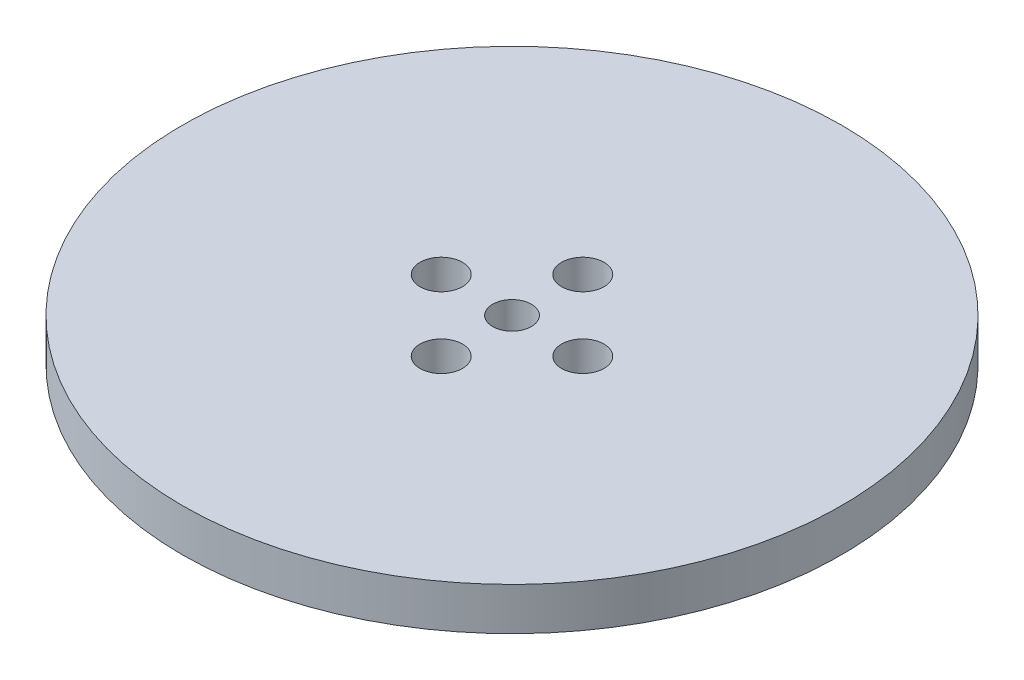
ISO-10303-21;
HEADER;
FILE_DESCRIPTION(('STEP AP214'),'2;1');
FILE_NAME('part.step','',(''),(''),'','','');
FILE_SCHEMA(('AUTOMOTIVE_DESIGN { 1 0 10303 214 1 1 1 1 }'));
ENDSEC;
DATA;
#1=APPLICATION_CONTEXT('core data for automotive mechanical design processes');
#2=APPLICATION_PROTOCOL_DEFINITION('international standard','automotive_design',2000,#1);
#3=PRODUCT_CONTEXT('',#1,'mechanical');
#4=PRODUCT('Part','Part','',(#3));
#5=PRODUCT_RELATED_PRODUCT_CATEGORY('part','',(#4));
#6=PRODUCT_DEFINITION_FORMATION('','',#4);
#7=PRODUCT_DEFINITION_CONTEXT('part definition',#1,'design');
#8=PRODUCT_DEFINITION('design','',#6,#7);
#9=PRODUCT_DEFINITION_SHAPE('','',#8);
#10=(LENGTH_UNIT() NAMED_UNIT(*) SI_UNIT(.MILLI.,.METRE.));
#11=(NAMED_UNIT(*) PLANE_ANGLE_UNIT() SI_UNIT($,.RADIAN.));
#12=(NAMED_UNIT(*) SI_UNIT($,.STERADIAN.) SOLID_ANGLE_UNIT());
#13=UNCERTAINTY_MEASURE_WITH_UNIT(LENGTH_MEASURE(1.E-05),#10,'distance_accuracy_value','');
#14=(GEOMETRIC_REPRESENTATION_CONTEXT(3) GLOBAL_UNCERTAINTY_ASSIGNED_CONTEXT((#13)) GLOBAL_UNIT_ASSIGNED_CONTEXT((#10,
#11,#12)) REPRESENTATION_CONTEXT('',''));
#15=CARTESIAN_POINT('',(0.,0.,0.));
#16=DIRECTION('',(0.,0.,1.));
#17=DIRECTION('',(1.,0.,0.));
#18=AXIS2_PLACEMENT_3D('',#15,#16,#17);
#19=CARTESIAN_POINT('',(0.,11.,0.));
#20=DIRECTION('',(0.,-1.,0.));
#21=DIRECTION('',(0.,0.,-1.));
#22=AXIS2_PLACEMENT_3D('',#19,#20,#21);
#23=CYLINDRICAL_SURFACE('',#22,85.);
#24=CARTESIAN_POINT('',(0.,11.,0.));
#25=DIRECTION('',(0.,1.,0.));
#26=DIRECTION('',(0.,0.,1.));
#27=AXIS2_PLACEMENT_3D('',#24,#25,#26);
#28=CIRCLE('',#27,85.);
#29=CARTESIAN_POINT('',(0.,11.,85.));
#30=VERTEX_POINT('',#29);
#31=EDGE_CURVE('E10',#30,#30,#28,.T.);
#32=ORIENTED_EDGE('',*,*,#31,.F.);
#33=EDGE_LOOP('',(#32));
#34=FACE_BOUND('',#33,.T.);
#35=CARTESIAN_POINT('',(0.,0.,0.));
#36=DIRECTION('',(0.,1.,0.));
#37=DIRECTION('',(0.,0.,1.));
#38=AXIS2_PLACEMENT_3D('',#35,#36,#37);
#39=CIRCLE('',#38,85.);
#40=CARTESIAN_POINT('',(0.,0.,85.));
#41=VERTEX_POINT('',#40);
#42=EDGE_CURVE('E37',#41,#41,#39,.T.);
#43=ORIENTED_EDGE('',*,*,#42,.T.);
#44=EDGE_LOOP('',(#43));
#45=FACE_BOUND('',#44,.T.);
#46=ADVANCED_FACE('F40',(#34,#45),#23,.T.);
#47=CARTESIAN_POINT('',(0.,11.,0.));
#48=DIRECTION('',(0.,1.,0.));
#49=DIRECTION('',(0.,0.,1.));
#50=AXIS2_PLACEMENT_3D('',#47,#48,#49);
#51=PLANE('',#50);
#52=CARTESIAN_POINT('',(0.,11.,18.2555288128649));
#53=DIRECTION('',(0.,1.,0.));
#54=DIRECTION('',(1.,0.,0.));
#55=AXIS2_PLACEMENT_3D('',#52,#53,#54);
#56=CIRCLE('',#55,5.47265481306155);
#57=CARTESIAN_POINT('',(5.47265481306161,11.,18.2555288128649));
#58=VERTEX_POINT('',#57);
#59=EDGE_CURVE('E71',#58,#58,#56,.T.);
#60=ORIENTED_EDGE('',*,*,#59,.F.);
#61=EDGE_LOOP('',(#60));
#62=FACE_BOUND('',#61,.T.);
#63=CARTESIAN_POINT('',(18.2555288128649,11.,0.));
#64=DIRECTION('',(0.,1.,0.));
#65=DIRECTION('',(0.,0.,-1.));
#66=AXIS2_PLACEMENT_3D('',#63,#64,#65);
#67=CIRCLE('',#66,5.47265481306155);
#68=CARTESIAN_POINT('',(18.2555288128649,11.,-5.47265481306155));
#69=VERTEX_POINT('',#68);
#70=EDGE_CURVE('E70',#69,#69,#67,.T.);
#71=ORIENTED_EDGE('',*,*,#70,.F.);
#72=EDGE_LOOP('',(#71));
#73=FACE_BOUND('',#72,.T.);
#74=CARTESIAN_POINT('',(-1.91216514542493E-13,11.,-18.2555288128649));
#75=DIRECTION('',(0.,1.,0.));
#76=DIRECTION('',(-1.,0.,0.));
#77=AXIS2_PLACEMENT_3D('',#74,#75,#76);
#78=CIRCLE('',#77,5.47265481306155);
#79=CARTESIAN_POINT('',(-5.47265481306174,11.,-18.2555288128649));
#80=VERTEX_POINT('',#79);
#81=EDGE_CURVE('E61',#80,#80,#78,.T.);
#82=ORIENTED_EDGE('',*,*,#81,.F.);
#83=EDGE_LOOP('',(#82));
#84=FACE_BOUND('',#83,.T.);
#85=CARTESIAN_POINT('',(-18.2555288128649,11.,0.));
#86=DIRECTION('',(0.,1.,0.));
#87=DIRECTION('',(0.,0.,1.));
#88=AXIS2_PLACEMENT_3D('',#85,#86,#87);
#89=CIRCLE('',#88,5.47265481306155);
#90=CARTESIAN_POINT('',(-18.2555288128649,11.,5.47265481306155));
#91=VERTEX_POINT('',#90);
#92=EDGE_CURVE('E54',#91,#91,#89,.T.);
#93=ORIENTED_EDGE('',*,*,#92,.F.);
#94=EDGE_LOOP('',(#93));
#95=FACE_BOUND('',#94,.T.);
#96=CARTESIAN_POINT('',(0.,11.,0.));
#97=DIRECTION('',(0.,1.,0.));
#98=DIRECTION('',(0.,0.,1.));
#99=AXIS2_PLACEMENT_3D('',#96,#97,#98);
#100=CIRCLE('',#99,5.);
#101=CARTESIAN_POINT('',(0.,11.,5.));
#102=VERTEX_POINT('',#101);
#103=EDGE_CURVE('E50',#102,#102,#100,.T.);
#104=ORIENTED_EDGE('',*,*,#103,.F.);
#105=EDGE_LOOP('',(#104));
#106=FACE_BOUND('',#105,.T.);
#107=ORIENTED_EDGE('',*,*,#31,.T.);
#108=EDGE_LOOP('',(#107));
#109=FACE_BOUND('',#108,.T.);
#110=ADVANCED_FACE('F86',(#62,#73,#84,#95,#106,#109),#51,.T.);
#111=CARTESIAN_POINT('',(0.,0.,0.));
#112=DIRECTION('',(0.,1.,0.));
#113=DIRECTION('',(0.,0.,1.));
#114=AXIS2_PLACEMENT_3D('',#111,#112,#113);
#115=PLANE('',#114);
#116=CARTESIAN_POINT('',(0.,0.,0.));
#117=DIRECTION('',(0.,1.,0.));
#118=DIRECTION('',(0.,0.,1.));
#119=AXIS2_PLACEMENT_3D('',#116,#117,#118);
#120=CIRCLE('',#119,5.);
#121=CARTESIAN_POINT('',(0.,0.,5.));
#122=VERTEX_POINT('',#121);
#123=EDGE_CURVE('E47',#122,#122,#120,.T.);
#124=ORIENTED_EDGE('',*,*,#123,.T.);
#125=EDGE_LOOP('',(#124));
#126=FACE_BOUND('',#125,.T.);
#127=ORIENTED_EDGE('',*,*,#42,.F.);
#128=EDGE_LOOP('',(#127));
#129=FACE_BOUND('',#128,.T.);
#130=ADVANCED_FACE('F93',(#126,#129),#115,.F.);
#131=CARTESIAN_POINT('',(0.,11.,0.));
#132=DIRECTION('',(0.,-1.,0.));
#133=DIRECTION('',(0.,0.,-1.));
#134=AXIS2_PLACEMENT_3D('',#131,#132,#133);
#135=CYLINDRICAL_SURFACE('',#134,5.);
#136=ORIENTED_EDGE('',*,*,#103,.T.);
#137=EDGE_LOOP('',(#136));
#138=FACE_BOUND('',#137,.T.);
#139=ORIENTED_EDGE('',*,*,#123,.F.);
#140=EDGE_LOOP('',(#139));
#141=FACE_BOUND('',#140,.T.);
#142=ADVANCED_FACE('F101',(#138,#141),#135,.F.);
#143=CARTESIAN_POINT('',(-18.2555288128649,2.5381638273613,0.));
#144=DIRECTION('',(0.,1.,0.));
#145=DIRECTION('',(0.,0.,1.));
#146=AXIS2_PLACEMENT_3D('',#143,#144,#145);
#147=CYLINDRICAL_SURFACE('',#146,5.47265481306155);
#148=CARTESIAN_POINT('',(-18.2555288128649,2.5381638273613,0.));
#149=DIRECTION('',(0.,1.,0.));
#150=DIRECTION('',(0.,0.,1.));
#151=AXIS2_PLACEMENT_3D('',#148,#149,#150);
#152=CIRCLE('',#151,5.47265481306155);
#153=CARTESIAN_POINT('',(-18.2555288128649,2.5381638273613,5.47265481306155));
#154=VERTEX_POINT('',#153);
#155=EDGE_CURVE('E55',#154,#154,#152,.T.);
#156=ORIENTED_EDGE('',*,*,#155,.F.);
#157=EDGE_LOOP('',(#156));
#158=FACE_BOUND('',#157,.T.);
#159=ORIENTED_EDGE('',*,*,#92,.T.);
#160=EDGE_LOOP('',(#159));
#161=FACE_BOUND('',#160,.T.);
#162=ADVANCED_FACE('F102',(#158,#161),#147,.F.);
#163=CARTESIAN_POINT('',(-18.2555288128649,2.5381638273613,0.));
#164=DIRECTION('',(0.,1.,0.));
#165=DIRECTION('',(0.,0.,1.));
#166=AXIS2_PLACEMENT_3D('',#163,#164,#165);
#167=PLANE('',#166);
#168=ORIENTED_EDGE('',*,*,#155,.T.);
#169=EDGE_LOOP('',(#168));
#170=FACE_BOUND('',#169,.T.);
#171=ADVANCED_FACE('F133',(#170),#167,.T.);
#172=CARTESIAN_POINT('',(-1.91216514542493E-13,2.5381638273613,-18.2555288128649));
#173=DIRECTION('',(0.,1.,0.));
#174=DIRECTION('',(0.,0.,1.));
#175=AXIS2_PLACEMENT_3D('',#172,#173,#174);
#176=CYLINDRICAL_SURFACE('',#175,5.47265481306155);
#177=CARTESIAN_POINT('',(-1.91216514542493E-13,2.5381638273613,-18.2555288128649));
#178=DIRECTION('',(0.,1.,0.));
#179=DIRECTION('',(-1.,0.,0.));
#180=AXIS2_PLACEMENT_3D('',#177,#178,#179);
#181=CIRCLE('',#180,5.47265481306155);
#182=CARTESIAN_POINT('',(-5.47265481306174,2.5381638273613,-18.2555288128649));
#183=VERTEX_POINT('',#182);
#184=EDGE_CURVE('E63',#183,#183,#181,.T.);
#185=ORIENTED_EDGE('',*,*,#184,.F.);
#186=EDGE_LOOP('',(#185));
#187=FACE_BOUND('',#186,.T.);
#188=ORIENTED_EDGE('',*,*,#81,.T.);
#189=EDGE_LOOP('',(#188));
#190=FACE_BOUND('',#189,.T.);
#191=ADVANCED_FACE('F142',(#187,#190),#176,.F.);
#192=CARTESIAN_POINT('',(-1.91216514542493E-13,2.5381638273613,-18.2555288128649));
#193=DIRECTION('',(0.,1.,0.));
#194=DIRECTION('',(-1.,0.,0.));
#195=AXIS2_PLACEMENT_3D('',#192,#193,#194);
#196=PLANE('',#195);
#197=ORIENTED_EDGE('',*,*,#184,.T.);
#198=EDGE_LOOP('',(#197));
#199=FACE_BOUND('',#198,.T.);
#200=ADVANCED_FACE('F156',(#199),#196,.T.);
#201=CARTESIAN_POINT('',(18.2555288128649,2.5381638273613,0.));
#202=DIRECTION('',(0.,1.,0.));
#203=DIRECTION('',(0.,0.,1.));
#204=AXIS2_PLACEMENT_3D('',#201,#202,#203);
#205=CYLINDRICAL_SURFACE('',#204,5.47265481306155);
#206=CARTESIAN_POINT('',(18.2555288128649,2.5381638273613,0.));
#207=DIRECTION('',(0.,1.,0.));
#208=DIRECTION('',(0.,0.,-1.));
#209=AXIS2_PLACEMENT_3D('',#206,#207,#208);
#210=CIRCLE('',#209,5.47265481306155);
#211=CARTESIAN_POINT('',(18.2555288128649,2.5381638273613,-5.47265481306155));
#212=VERTEX_POINT('',#211);
#213=EDGE_CURVE('E69',#212,#212,#210,.T.);
#214=ORIENTED_EDGE('',*,*,#213,.F.);
#215=EDGE_LOOP('',(#214));
#216=FACE_BOUND('',#215,.T.);
#217=ORIENTED_EDGE('',*,*,#70,.T.);
#218=EDGE_LOOP('',(#217));
#219=FACE_BOUND('',#218,.T.);
#220=ADVANCED_FACE('F164',(#216,#219),#205,.F.);
#221=CARTESIAN_POINT('',(18.2555288128649,2.5381638273613,0.));
#222=DIRECTION('',(0.,1.,0.));
#223=DIRECTION('',(0.,0.,-1.));
#224=AXIS2_PLACEMENT_3D('',#221,#222,#223);
#225=PLANE('',#224);
#226=ORIENTED_EDGE('',*,*,#213,.T.);
#227=EDGE_LOOP('',(#226));
#228=FACE_BOUND('',#227,.T.);
#229=ADVANCED_FACE('F83',(#228),#225,.T.);
#230=CARTESIAN_POINT('',(0.,2.5381638273613,18.2555288128649));
#231=DIRECTION('',(0.,1.,0.));
#232=DIRECTION('',(0.,0.,1.));
#233=AXIS2_PLACEMENT_3D('',#230,#231,#232);
#234=CYLINDRICAL_SURFACE('',#233,5.47265481306155);
#235=CARTESIAN_POINT('',(0.,2.5381638273613,18.2555288128649));
#236=DIRECTION('',(0.,1.,0.));
#237=DIRECTION('',(1.,0.,0.));
#238=AXIS2_PLACEMENT_3D('',#235,#236,#237);
#239=CIRCLE('',#238,5.47265481306155);
#240=CARTESIAN_POINT('',(5.47265481306161,2.5381638273613,18.2555288128649));
#241=VERTEX_POINT('',#240);
#242=EDGE_CURVE('E59',#241,#241,#239,.T.);
#243=ORIENTED_EDGE('',*,*,#242,.F.);
#244=EDGE_LOOP('',(#243));
#245=FACE_BOUND('',#244,.T.);
#246=ORIENTED_EDGE('',*,*,#59,.T.);
#247=EDGE_LOOP('',(#246));
#248=FACE_BOUND('',#247,.T.);
#249=ADVANCED_FACE('F81',(#245,#248),#234,.F.);
#250=CARTESIAN_POINT('',(0.,2.5381638273613,18.2555288128649));
#251=DIRECTION('',(0.,1.,0.));
#252=DIRECTION('',(1.,0.,0.));
#253=AXIS2_PLACEMENT_3D('',#250,#251,#252);
#254=PLANE('',#253);
#255=ORIENTED_EDGE('',*,*,#242,.T.);
#256=EDGE_LOOP('',(#255));
#257=FACE_BOUND('',#256,.T.);
#258=ADVANCED_FACE('F78',(#257),#254,.T.);
#259=CLOSED_SHELL('',(#46,#110,#130,#142,#162,#171,#191,#200,#220,#229,#249,#258));
#260=MANIFOLD_SOLID_BREP('B2',#259);
#261=ADVANCED_BREP_SHAPE_REPRESENTATION('',(#18,#260),#14);
#262=SHAPE_DEFINITION_REPRESENTATION(#9,#261);
ENDSEC;
END-ISO-10303-21;
